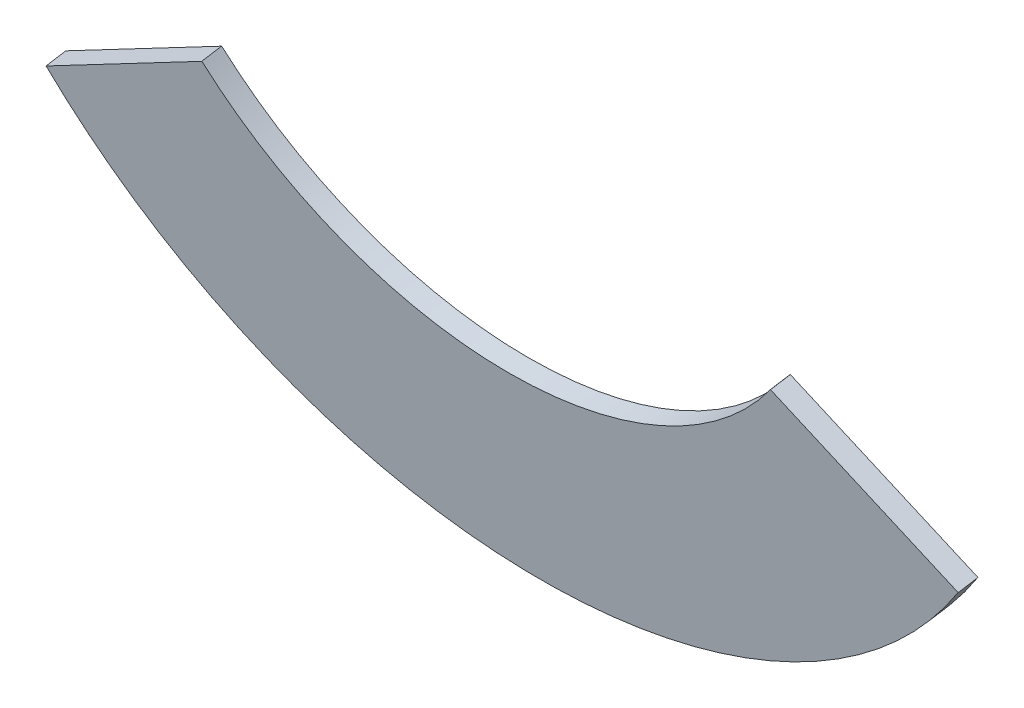
ISO-10303-21;
HEADER;
FILE_DESCRIPTION(('STEP AP214'),'2;1');
FILE_NAME('part.step','',(''),(''),'','','');
FILE_SCHEMA(('AUTOMOTIVE_DESIGN { 1 0 10303 214 1 1 1 1 }'));
ENDSEC;
DATA;
#1=APPLICATION_CONTEXT('core data for automotive mechanical design processes');
#2=APPLICATION_PROTOCOL_DEFINITION('international standard','automotive_design',2000,#1);
#3=PRODUCT_CONTEXT('',#1,'mechanical');
#4=PRODUCT('Part','Part','',(#3));
#5=PRODUCT_RELATED_PRODUCT_CATEGORY('part','',(#4));
#6=PRODUCT_DEFINITION_FORMATION('','',#4);
#7=PRODUCT_DEFINITION_CONTEXT('part definition',#1,'design');
#8=PRODUCT_DEFINITION('design','',#6,#7);
#9=PRODUCT_DEFINITION_SHAPE('','',#8);
#10=(LENGTH_UNIT() NAMED_UNIT(*) SI_UNIT(.MILLI.,.METRE.));
#11=(NAMED_UNIT(*) PLANE_ANGLE_UNIT() SI_UNIT($,.RADIAN.));
#12=(NAMED_UNIT(*) SI_UNIT($,.STERADIAN.) SOLID_ANGLE_UNIT());
#13=UNCERTAINTY_MEASURE_WITH_UNIT(LENGTH_MEASURE(1.E-05),#10,'distance_accuracy_value','');
#14=(GEOMETRIC_REPRESENTATION_CONTEXT(3) GLOBAL_UNCERTAINTY_ASSIGNED_CONTEXT((#13)) GLOBAL_UNIT_ASSIGNED_CONTEXT((#10,
#11,#12)) REPRESENTATION_CONTEXT('',''));
#15=CARTESIAN_POINT('',(0.,0.,0.));
#16=DIRECTION('',(0.,0.,1.));
#17=DIRECTION('',(1.,0.,0.));
#18=AXIS2_PLACEMENT_3D('',#15,#16,#17);
#19=CARTESIAN_POINT('',(-105.680140416231,15.8157726153586,31.1722337317798));
#20=DIRECTION('',(0.982534179432697,0.183664487094564,0.0298988699921383));
#21=DIRECTION('',(-0.18374663491389,0.982973638587435,0.));
#22=AXIS2_PLACEMENT_3D('',#19,#20,#21);
#23=PLANE('',#22);
#24=DIRECTION('',(0.186082202927942,-0.969768378055282,-0.157869270846204));
#25=VECTOR('',#24,1.);
#26=CARTESIAN_POINT('',(-105.680140416231,15.9340220675879,30.4458442395139));
#27=LINE('',#26,#25);
#28=CARTESIAN_POINT('',(-105.765651929608,16.3796657687465,30.5183908885397));
#29=VERTEX_POINT('',#28);
#30=CARTESIAN_POINT('',(-105.764809771277,16.3752768561785,30.5176764144007));
#31=VERTEX_POINT('',#30);
#32=EDGE_CURVE('E112',#29,#31,#27,.T.);
#33=ORIENTED_EDGE('',*,*,#32,.F.);
#34=DIRECTION('',(0.,0.160675602081711,-0.987007269930511));
#35=VECTOR('',#34,1.);
#36=CARTESIAN_POINT('',(-105.765651929608,16.2614163165172,31.2447803808057));
#37=LINE('',#36,#35);
#38=CARTESIAN_POINT('',(-105.765651929608,16.2614163165172,31.2447803808057));
#39=VERTEX_POINT('',#38);
#40=EDGE_CURVE('E32',#39,#29,#37,.T.);
#41=ORIENTED_EDGE('',*,*,#40,.F.);
#42=DIRECTION('',(0.186082202927942,-0.969768378055282,-0.157869270846204));
#43=VECTOR('',#42,1.);
#44=CARTESIAN_POINT('',(-105.680140416231,15.8157726153586,31.1722337317798));
#45=LINE('',#44,#43);
#46=CARTESIAN_POINT('',(-105.764809771277,16.2570274039491,31.2440659066667));
#47=VERTEX_POINT('',#46);
#48=EDGE_CURVE('E132',#39,#47,#45,.T.);
#49=ORIENTED_EDGE('',*,*,#48,.T.);
#50=DIRECTION('',(0.,0.160675602081711,-0.987007269930511));
#51=VECTOR('',#50,1.);
#52=CARTESIAN_POINT('',(-105.764809771277,16.2570274039491,31.2440659066667));
#53=LINE('',#52,#51);
#54=EDGE_CURVE('E10',#47,#31,#53,.T.);
#55=ORIENTED_EDGE('',*,*,#54,.T.);
#56=EDGE_LOOP('',(#33,#41,#49,#55));
#57=FACE_BOUND('',#56,.T.);
#58=ADVANCED_FACE('F16',(#57),#23,.T.);
#59=CARTESIAN_POINT('',(-105.764809771277,16.2570274039491,31.2440659066667));
#60=DIRECTION('',(0.5,0.854773369479747,0.139149153171122));
#61=DIRECTION('',(-0.863170783338306,0.504912070355953,0.));
#62=AXIS2_PLACEMENT_3D('',#59,#60,#61);
#63=PLANE('',#62);
#64=DIRECTION('',(0.866025403784439,-0.493503634965255,-0.0803378010408555));
#65=VECTOR('',#64,1.);
#66=CARTESIAN_POINT('',(-105.764809771277,16.3752768561785,30.5176764144007));
#67=LINE('',#66,#65);
#68=CARTESIAN_POINT('',(-99.4624275413655,12.7838711932381,29.9330289808988));
#69=VERTEX_POINT('',#68);
#70=EDGE_CURVE('E115',#31,#69,#67,.T.);
#71=ORIENTED_EDGE('',*,*,#70,.F.);
#72=ORIENTED_EDGE('',*,*,#54,.F.);
#73=DIRECTION('',(0.866025403784439,-0.493503634965255,-0.0803378010408555));
#74=VECTOR('',#73,1.);
#75=CARTESIAN_POINT('',(-105.764809771277,16.2570274039491,31.2440659066667));
#76=LINE('',#75,#74);
#77=CARTESIAN_POINT('',(-99.4624275413655,12.6656217410088,30.6594184731648));
#78=VERTEX_POINT('',#77);
#79=EDGE_CURVE('E141',#47,#78,#76,.T.);
#80=ORIENTED_EDGE('',*,*,#79,.T.);
#81=DIRECTION('',(0.,0.160675602081711,-0.987007269930511));
#82=VECTOR('',#81,1.);
#83=CARTESIAN_POINT('',(-99.4624275413655,12.6656217410088,30.6594184731648));
#84=LINE('',#83,#82);
#85=EDGE_CURVE('E24',#78,#69,#84,.T.);
#86=ORIENTED_EDGE('',*,*,#85,.T.);
#87=EDGE_LOOP('',(#71,#72,#80,#86));
#88=FACE_BOUND('',#87,.T.);
#89=ADVANCED_FACE('F140',(#88),#63,.T.);
#90=CARTESIAN_POINT('',(-99.4624275413655,12.6656217410088,30.6594184731648));
#91=DIRECTION('',(0.210137577576338,-0.9649691994322,-0.157088009209893));
#92=DIRECTION('',(0.977100282760843,0.212779316261425,0.));
#93=AXIS2_PLACEMENT_3D('',#90,#91,#92);
#94=PLANE('',#93);
#95=DIRECTION('',(-0.977671825558223,-0.20740731675343,-0.033763981797085));
#96=VECTOR('',#95,1.);
#97=CARTESIAN_POINT('',(-99.4624275413655,12.7838711932381,29.9330289808988));
#98=LINE('',#97,#96);
#99=CARTESIAN_POINT('',(-99.4675284592525,12.7827890635661,29.9328528202545));
#100=VERTEX_POINT('',#99);
#101=EDGE_CURVE('E118',#69,#100,#98,.T.);
#102=ORIENTED_EDGE('',*,*,#101,.F.);
#103=ORIENTED_EDGE('',*,*,#85,.F.);
#104=DIRECTION('',(-0.977671825558223,-0.20740731675343,-0.033763981797085));
#105=VECTOR('',#104,1.);
#106=CARTESIAN_POINT('',(-99.4624275413655,12.6656217410088,30.6594184731648));
#107=LINE('',#106,#105);
#108=CARTESIAN_POINT('',(-99.4675284592525,12.6645396113368,30.6592423125205));
#109=VERTEX_POINT('',#108);
#110=EDGE_CURVE('E150',#78,#109,#107,.T.);
#111=ORIENTED_EDGE('',*,*,#110,.T.);
#112=DIRECTION('',(0.,0.160675602081711,-0.987007269930511));
#113=VECTOR('',#112,1.);
#114=CARTESIAN_POINT('',(-99.4675284592525,12.6645396113368,30.6592423125205));
#115=LINE('',#114,#113);
#116=EDGE_CURVE('E138',#109,#100,#115,.T.);
#117=ORIENTED_EDGE('',*,*,#116,.T.);
#118=EDGE_LOOP('',(#102,#103,#111,#117));
#119=FACE_BOUND('',#118,.T.);
#120=ADVANCED_FACE('F145',(#119),#94,.T.);
#121=CARTESIAN_POINT('',(-116.1986852462,24.0891496048619,32.5190625440246));
#122=DIRECTION('',(0.,0.160675602081711,-0.987007269930511));
#123=DIRECTION('',(0.,0.987007269930511,0.160675602081711));
#124=AXIS2_PLACEMENT_3D('',#121,#122,#123);
#125=CYLINDRICAL_SURFACE('',#124,20.3448335512258);
#126=CARTESIAN_POINT('',(-116.1986852462,24.2073990570913,31.7926730517586));
#127=DIRECTION('',(0.,0.160675602081711,-0.987007269930511));
#128=DIRECTION('',(0.822378651799751,-0.561548462156712,-0.0914148659324881));
#129=AXIS2_PLACEMENT_3D('',#126,#127,#128);
#130=CIRCLE('',#129,20.3448335512258);
#131=CARTESIAN_POINT('',(-132.929842033147,12.7827890635661,29.9328528202545));
#132=VERTEX_POINT('',#131);
#133=EDGE_CURVE('E121',#100,#132,#130,.T.);
#134=ORIENTED_EDGE('',*,*,#133,.F.);
#135=ORIENTED_EDGE('',*,*,#116,.F.);
#136=CARTESIAN_POINT('',(-116.1986852462,24.0891496048619,32.5190625440246));
#137=DIRECTION('',(0.,0.160675602081711,-0.987007269930511));
#138=DIRECTION('',(0.822378651799751,-0.561548462156712,-0.0914148659324881));
#139=AXIS2_PLACEMENT_3D('',#136,#137,#138);
#140=CIRCLE('',#139,20.3448335512258);
#141=CARTESIAN_POINT('',(-132.929842033147,12.6645396113368,30.6592423125205));
#142=VERTEX_POINT('',#141);
#143=EDGE_CURVE('E154',#109,#142,#140,.T.);
#144=ORIENTED_EDGE('',*,*,#143,.T.);
#145=DIRECTION('',(0.,0.160675602081711,-0.987007269930511));
#146=VECTOR('',#145,1.);
#147=CARTESIAN_POINT('',(-132.929842033147,12.6645396113368,30.6592423125205));
#148=LINE('',#147,#146);
#149=EDGE_CURVE('E136',#142,#132,#148,.T.);
#150=ORIENTED_EDGE('',*,*,#149,.T.);
#151=EDGE_LOOP('',(#134,#135,#144,#150));
#152=FACE_BOUND('',#151,.T.);
#153=ADVANCED_FACE('F161',(#152),#125,.T.);
#154=CARTESIAN_POINT('',(-132.432373185814,12.5590045267649,30.6420621824739));
#155=DIRECTION('',(-0.21013757757633,-0.964969199432202,-0.157088009209893));
#156=DIRECTION('',(0.977100282760845,-0.212779316261417,0.));
#157=AXIS2_PLACEMENT_3D('',#154,#155,#156);
#158=PLANE('',#157);
#159=DIRECTION('',(-0.977671825558225,0.207407316753425,0.0337639817970629));
#160=VECTOR('',#159,1.);
#161=CARTESIAN_POINT('',(-132.432373185814,12.6772539789943,29.9156726902079));
#162=LINE('',#161,#160);
#163=CARTESIAN_POINT('',(-132.934942951035,12.7838711932381,29.9330289808988));
#164=VERTEX_POINT('',#163);
#165=EDGE_CURVE('E124',#132,#164,#162,.T.);
#166=ORIENTED_EDGE('',*,*,#165,.F.);
#167=ORIENTED_EDGE('',*,*,#149,.F.);
#168=DIRECTION('',(-0.977671825558225,0.207407316753425,0.0337639817970629));
#169=VECTOR('',#168,1.);
#170=CARTESIAN_POINT('',(-132.432373185814,12.5590045267649,30.6420621824739));
#171=LINE('',#170,#169);
#172=CARTESIAN_POINT('',(-132.934942951035,12.6656217410088,30.6594184731648));
#173=VERTEX_POINT('',#172);
#174=EDGE_CURVE('E103',#142,#173,#171,.T.);
#175=ORIENTED_EDGE('',*,*,#174,.T.);
#176=DIRECTION('',(0.,0.160675602081711,-0.987007269930511));
#177=VECTOR('',#176,1.);
#178=CARTESIAN_POINT('',(-132.934942951035,12.6656217410088,30.6594184731648));
#179=LINE('',#178,#177);
#180=EDGE_CURVE('E95',#173,#164,#179,.T.);
#181=ORIENTED_EDGE('',*,*,#180,.T.);
#182=EDGE_LOOP('',(#166,#167,#175,#181));
#183=FACE_BOUND('',#182,.T.);
#184=ADVANCED_FACE('F158',(#183),#158,.T.);
#185=CARTESIAN_POINT('',(-132.934942951035,12.6656217410088,30.6594184731648));
#186=DIRECTION('',(-0.5,0.854773369479747,0.139149153171122));
#187=DIRECTION('',(-0.863170783338306,-0.504912070355953,0.));
#188=AXIS2_PLACEMENT_3D('',#185,#186,#187);
#189=PLANE('',#188);
#190=DIRECTION('',(0.866025403784439,0.493503634965256,0.0803378010408556));
#191=VECTOR('',#190,1.);
#192=CARTESIAN_POINT('',(-132.934942951035,12.7838711932381,29.9330289808988));
#193=LINE('',#192,#191);
#194=CARTESIAN_POINT('',(-126.632560721123,16.3752768561785,30.5176764144007));
#195=VERTEX_POINT('',#194);
#196=EDGE_CURVE('E127',#164,#195,#193,.T.);
#197=ORIENTED_EDGE('',*,*,#196,.F.);
#198=ORIENTED_EDGE('',*,*,#180,.F.);
#199=DIRECTION('',(0.866025403784439,0.493503634965256,0.0803378010408556));
#200=VECTOR('',#199,1.);
#201=CARTESIAN_POINT('',(-132.934942951035,12.6656217410088,30.6594184731648));
#202=LINE('',#201,#200);
#203=CARTESIAN_POINT('',(-126.632560721123,16.2570274039492,31.2440659066667));
#204=VERTEX_POINT('',#203);
#205=EDGE_CURVE('E98',#173,#204,#202,.T.);
#206=ORIENTED_EDGE('',*,*,#205,.T.);
#207=DIRECTION('',(0.,0.160675602081711,-0.987007269930511));
#208=VECTOR('',#207,1.);
#209=CARTESIAN_POINT('',(-126.632560721123,16.2570274039492,31.2440659066667));
#210=LINE('',#209,#208);
#211=EDGE_CURVE('E84',#204,#195,#210,.T.);
#212=ORIENTED_EDGE('',*,*,#211,.T.);
#213=EDGE_LOOP('',(#197,#198,#206,#212));
#214=FACE_BOUND('',#213,.T.);
#215=ADVANCED_FACE('F99',(#214),#189,.T.);
#216=CARTESIAN_POINT('',(-126.717230076169,15.8157726153586,31.1722337317798));
#217=DIRECTION('',(-0.982534179432695,0.183664487094575,0.0298988699921401));
#218=DIRECTION('',(-0.183746634913901,-0.982973638587433,0.));
#219=AXIS2_PLACEMENT_3D('',#216,#217,#218);
#220=PLANE('',#219);
#221=DIRECTION('',(0.186082202927954,0.969768378055279,0.157869270846206));
#222=VECTOR('',#221,1.);
#223=CARTESIAN_POINT('',(-126.717230076169,15.934022067588,30.4458442395139));
#224=LINE('',#223,#222);
#225=CARTESIAN_POINT('',(-126.631718562792,16.3796657687465,30.5183908885397));
#226=VERTEX_POINT('',#225);
#227=EDGE_CURVE('E91',#195,#226,#224,.T.);
#228=ORIENTED_EDGE('',*,*,#227,.F.);
#229=ORIENTED_EDGE('',*,*,#211,.F.);
#230=DIRECTION('',(0.186082202927954,0.969768378055279,0.157869270846206));
#231=VECTOR('',#230,1.);
#232=CARTESIAN_POINT('',(-126.717230076169,15.8157726153586,31.1722337317798));
#233=LINE('',#232,#231);
#234=CARTESIAN_POINT('',(-126.631718562792,16.2614163165172,31.2447803808057));
#235=VERTEX_POINT('',#234);
#236=EDGE_CURVE('E88',#204,#235,#233,.T.);
#237=ORIENTED_EDGE('',*,*,#236,.T.);
#238=DIRECTION('',(0.,0.160675602081711,-0.987007269930511));
#239=VECTOR('',#238,1.);
#240=CARTESIAN_POINT('',(-126.631718562792,16.2614163165172,31.2447803808057));
#241=LINE('',#240,#239);
#242=EDGE_CURVE('E60',#235,#226,#241,.T.);
#243=ORIENTED_EDGE('',*,*,#242,.T.);
#244=EDGE_LOOP('',(#228,#229,#237,#243));
#245=FACE_BOUND('',#244,.T.);
#246=ADVANCED_FACE('F86',(#245),#220,.T.);
#247=CARTESIAN_POINT('',(-116.1986852462,24.089149604862,32.5190625440246));
#248=DIRECTION('',(0.,0.160675602081711,-0.987007269930511));
#249=DIRECTION('',(0.,0.987007269930511,0.160675602081711));
#250=AXIS2_PLACEMENT_3D('',#247,#248,#249);
#251=CYLINDRICAL_SURFACE('',#250,13.1051664487742);
#252=CARTESIAN_POINT('',(-116.1986852462,24.2073990570914,31.7926730517586));
#253=DIRECTION('',(0.,-0.160675602081711,0.987007269930511));
#254=DIRECTION('',(-0.796100786462559,-0.597301325316404,-0.0972350994701123));
#255=AXIS2_PLACEMENT_3D('',#252,#253,#254);
#256=CIRCLE('',#255,13.1051664487742);
#257=EDGE_CURVE('E130',#226,#29,#256,.T.);
#258=ORIENTED_EDGE('',*,*,#257,.F.);
#259=ORIENTED_EDGE('',*,*,#242,.F.);
#260=CARTESIAN_POINT('',(-116.1986852462,24.089149604862,32.5190625440246));
#261=DIRECTION('',(0.,-0.160675602081711,0.987007269930511));
#262=DIRECTION('',(-0.796100786462559,-0.597301325316404,-0.0972350994701123));
#263=AXIS2_PLACEMENT_3D('',#260,#261,#262);
#264=CIRCLE('',#263,13.1051664487742);
#265=EDGE_CURVE('E107',#235,#39,#264,.T.);
#266=ORIENTED_EDGE('',*,*,#265,.T.);
#267=ORIENTED_EDGE('',*,*,#40,.T.);
#268=EDGE_LOOP('',(#258,#259,#266,#267));
#269=FACE_BOUND('',#268,.T.);
#270=ADVANCED_FACE('F213',(#269),#251,.F.);
#271=CARTESIAN_POINT('',(-116.1986852462,-0.868410127831424,28.4562039828884));
#272=DIRECTION('',(0.,0.160675602081711,-0.98700726993051));
#273=DIRECTION('',(-1.,0.,0.));
#274=AXIS2_PLACEMENT_3D('',#271,#272,#273);
#275=PLANE('',#274);
#276=ORIENTED_EDGE('',*,*,#48,.F.);
#277=ORIENTED_EDGE('',*,*,#265,.F.);
#278=ORIENTED_EDGE('',*,*,#236,.F.);
#279=ORIENTED_EDGE('',*,*,#205,.F.);
#280=ORIENTED_EDGE('',*,*,#174,.F.);
#281=ORIENTED_EDGE('',*,*,#143,.F.);
#282=ORIENTED_EDGE('',*,*,#110,.F.);
#283=ORIENTED_EDGE('',*,*,#79,.F.);
#284=EDGE_LOOP('',(#276,#277,#278,#279,#280,#281,#282,#283));
#285=FACE_BOUND('',#284,.T.);
#286=ADVANCED_FACE('F106',(#285),#275,.F.);
#287=CARTESIAN_POINT('',(-116.1986852462,-0.750160675602082,27.7298144906225));
#288=DIRECTION('',(0.,0.160675602081711,-0.98700726993051));
#289=DIRECTION('',(-1.,0.,0.));
#290=AXIS2_PLACEMENT_3D('',#287,#288,#289);
#291=PLANE('',#290);
#292=ORIENTED_EDGE('',*,*,#32,.T.);
#293=ORIENTED_EDGE('',*,*,#70,.T.);
#294=ORIENTED_EDGE('',*,*,#101,.T.);
#295=ORIENTED_EDGE('',*,*,#133,.T.);
#296=ORIENTED_EDGE('',*,*,#165,.T.);
#297=ORIENTED_EDGE('',*,*,#196,.T.);
#298=ORIENTED_EDGE('',*,*,#227,.T.);
#299=ORIENTED_EDGE('',*,*,#257,.T.);
#300=EDGE_LOOP('',(#292,#293,#294,#295,#296,#297,#298,#299));
#301=FACE_BOUND('',#300,.T.);
#302=ADVANCED_FACE('F148',(#301),#291,.T.);
#303=CLOSED_SHELL('',(#58,#89,#120,#153,#184,#215,#246,#270,#286,#302));
#304=MANIFOLD_SOLID_BREP('B1',#303);
#305=ADVANCED_BREP_SHAPE_REPRESENTATION('',(#18,#304),#14);
#306=SHAPE_DEFINITION_REPRESENTATION(#9,#305);
ENDSEC;
END-ISO-10303-21;
